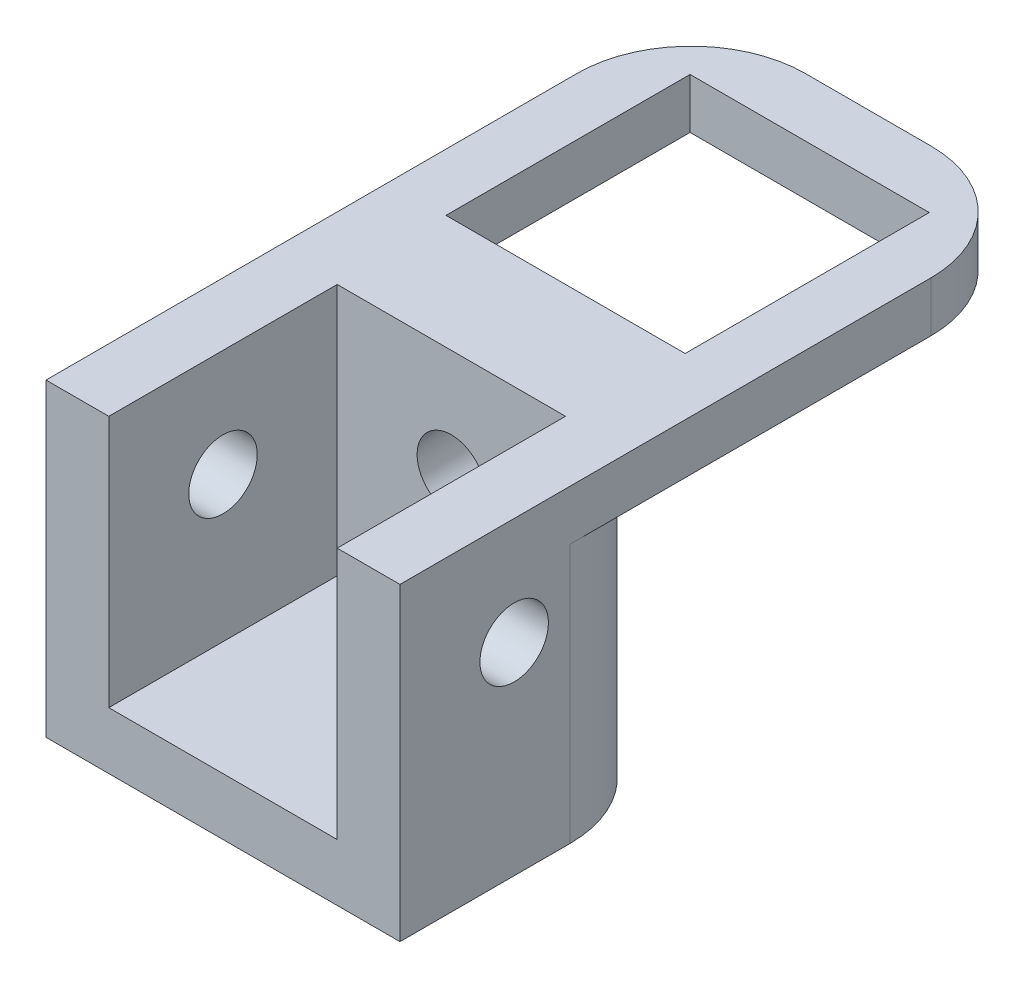
ISO-10303-21;
HEADER;
FILE_DESCRIPTION(('STEP AP214'),'2;1');
FILE_NAME('part.step','',(''),(''),'','','');
FILE_SCHEMA(('AUTOMOTIVE_DESIGN { 1 0 10303 214 1 1 1 1 }'));
ENDSEC;
DATA;
#1=APPLICATION_CONTEXT('core data for automotive mechanical design processes');
#2=APPLICATION_PROTOCOL_DEFINITION('international standard','automotive_design',2000,#1);
#3=PRODUCT_CONTEXT('',#1,'mechanical');
#4=PRODUCT('Part','Part','',(#3));
#5=PRODUCT_RELATED_PRODUCT_CATEGORY('part','',(#4));
#6=PRODUCT_DEFINITION_FORMATION('','',#4);
#7=PRODUCT_DEFINITION_CONTEXT('part definition',#1,'design');
#8=PRODUCT_DEFINITION('design','',#6,#7);
#9=PRODUCT_DEFINITION_SHAPE('','',#8);
#10=(LENGTH_UNIT() NAMED_UNIT(*) SI_UNIT(.MILLI.,.METRE.));
#11=(NAMED_UNIT(*) PLANE_ANGLE_UNIT() SI_UNIT($,.RADIAN.));
#12=(NAMED_UNIT(*) SI_UNIT($,.STERADIAN.) SOLID_ANGLE_UNIT());
#13=UNCERTAINTY_MEASURE_WITH_UNIT(LENGTH_MEASURE(1.E-05),#10,'distance_accuracy_value','');
#14=(GEOMETRIC_REPRESENTATION_CONTEXT(3) GLOBAL_UNCERTAINTY_ASSIGNED_CONTEXT((#13)) GLOBAL_UNIT_ASSIGNED_CONTEXT((#10,
#11,#12)) REPRESENTATION_CONTEXT('',''));
#15=CARTESIAN_POINT('',(0.,0.,0.));
#16=DIRECTION('',(0.,0.,1.));
#17=DIRECTION('',(1.,0.,0.));
#18=AXIS2_PLACEMENT_3D('',#15,#16,#17);
#19=CARTESIAN_POINT('',(-15.5,-4.4,20.405));
#20=DIRECTION('',(0.,0.,-1.));
#21=DIRECTION('',(-1.,0.,0.));
#22=AXIS2_PLACEMENT_3D('',#19,#20,#21);
#23=PLANE('',#22);
#24=CARTESIAN_POINT('',(0.,-9.4,20.405));
#25=DIRECTION('',(0.,0.,-1.));
#26=DIRECTION('',(-1.,0.,0.));
#27=AXIS2_PLACEMENT_3D('',#24,#25,#26);
#28=CIRCLE('',#27,3.);
#29=CARTESIAN_POINT('',(-3.,-9.4,20.405));
#30=VERTEX_POINT('',#29);
#31=EDGE_CURVE('E238',#30,#30,#28,.T.);
#32=ORIENTED_EDGE('',*,*,#31,.T.);
#33=EDGE_LOOP('',(#32));
#34=FACE_BOUND('',#33,.T.);
#35=DIRECTION('',(-1.,0.,0.));
#36=VECTOR('',#35,1.);
#37=CARTESIAN_POINT('',(15.502,-22.1,20.405));
#38=LINE('',#37,#36);
#39=CARTESIAN_POINT('',(10.,-22.1,20.405));
#40=VERTEX_POINT('',#39);
#41=CARTESIAN_POINT('',(-10.,-22.1,20.405));
#42=VERTEX_POINT('',#41);
#43=EDGE_CURVE('E171',#40,#42,#38,.T.);
#44=ORIENTED_EDGE('',*,*,#43,.F.);
#45=DIRECTION('',(0.,-1.,0.));
#46=VECTOR('',#45,1.);
#47=CARTESIAN_POINT('',(10.,0.,20.405));
#48=LINE('',#47,#46);
#49=CARTESIAN_POINT('',(10.,0.,20.405));
#50=VERTEX_POINT('',#49);
#51=EDGE_CURVE('E202',#50,#40,#48,.T.);
#52=ORIENTED_EDGE('',*,*,#51,.F.);
#53=DIRECTION('',(-1.,0.,0.));
#54=VECTOR('',#53,1.);
#55=CARTESIAN_POINT('',(-15.5,0.,20.405));
#56=LINE('',#55,#54);
#57=CARTESIAN_POINT('',(-10.,0.,20.405));
#58=VERTEX_POINT('',#57);
#59=EDGE_CURVE('E191',#50,#58,#56,.T.);
#60=ORIENTED_EDGE('',*,*,#59,.T.);
#61=DIRECTION('',(0.,1.,0.));
#62=VECTOR('',#61,1.);
#63=CARTESIAN_POINT('',(-10.,0.,20.405));
#64=LINE('',#63,#62);
#65=EDGE_CURVE('E185',#42,#58,#64,.T.);
#66=ORIENTED_EDGE('',*,*,#65,.F.);
#67=EDGE_LOOP('',(#44,#52,#60,#66));
#68=FACE_BOUND('',#67,.T.);
#69=ADVANCED_FACE('F45',(#34,#68),#23,.F.);
#70=CARTESIAN_POINT('',(10.,0.,68.0574863258261));
#71=DIRECTION('',(1.,0.,0.));
#72=DIRECTION('',(0.,1.,0.));
#73=AXIS2_PLACEMENT_3D('',#70,#71,#72);
#74=PLANE('',#73);
#75=CARTESIAN_POINT('',(10.,-9.4,30.405));
#76=DIRECTION('',(1.,0.,0.));
#77=DIRECTION('',(0.,1.,0.));
#78=AXIS2_PLACEMENT_3D('',#75,#76,#77);
#79=CIRCLE('',#78,3.);
#80=CARTESIAN_POINT('',(10.,-6.4,30.405));
#81=VERTEX_POINT('',#80);
#82=EDGE_CURVE('E286',#81,#81,#79,.T.);
#83=ORIENTED_EDGE('',*,*,#82,.T.);
#84=EDGE_LOOP('',(#83));
#85=FACE_BOUND('',#84,.T.);
#86=DIRECTION('',(0.,0.,1.));
#87=VECTOR('',#86,1.);
#88=CARTESIAN_POINT('',(10.,-22.1,40.405));
#89=LINE('',#88,#87);
#90=CARTESIAN_POINT('',(10.,-22.1,40.405));
#91=VERTEX_POINT('',#90);
#92=EDGE_CURVE('E174',#40,#91,#89,.T.);
#93=ORIENTED_EDGE('',*,*,#92,.T.);
#94=DIRECTION('',(0.,-1.,0.));
#95=VECTOR('',#94,1.);
#96=CARTESIAN_POINT('',(10.,0.,40.405));
#97=LINE('',#96,#95);
#98=CARTESIAN_POINT('',(10.,0.,40.405));
#99=VERTEX_POINT('',#98);
#100=EDGE_CURVE('E225',#99,#91,#97,.T.);
#101=ORIENTED_EDGE('',*,*,#100,.F.);
#102=DIRECTION('',(0.,0.,-1.));
#103=VECTOR('',#102,1.);
#104=CARTESIAN_POINT('',(10.,0.,68.0574863258261));
#105=LINE('',#104,#103);
#106=EDGE_CURVE('E195',#99,#50,#105,.T.);
#107=ORIENTED_EDGE('',*,*,#106,.T.);
#108=ORIENTED_EDGE('',*,*,#51,.T.);
#109=EDGE_LOOP('',(#93,#101,#107,#108));
#110=FACE_BOUND('',#109,.T.);
#111=ADVANCED_FACE('F434',(#85,#110),#74,.F.);
#112=CARTESIAN_POINT('',(-10.,0.,68.0574863258261));
#113=DIRECTION('',(-1.,0.,0.));
#114=DIRECTION('',(0.,-1.,0.));
#115=AXIS2_PLACEMENT_3D('',#112,#113,#114);
#116=PLANE('',#115);
#117=CARTESIAN_POINT('',(-10.,-9.4,30.405));
#118=DIRECTION('',(-1.,0.,0.));
#119=DIRECTION('',(0.,-1.,0.));
#120=AXIS2_PLACEMENT_3D('',#117,#118,#119);
#121=CIRCLE('',#120,3.);
#122=CARTESIAN_POINT('',(-10.,-12.4,30.405));
#123=VERTEX_POINT('',#122);
#124=EDGE_CURVE('E282',#123,#123,#121,.T.);
#125=ORIENTED_EDGE('',*,*,#124,.T.);
#126=EDGE_LOOP('',(#125));
#127=FACE_BOUND('',#126,.T.);
#128=DIRECTION('',(0.,0.,1.));
#129=VECTOR('',#128,1.);
#130=CARTESIAN_POINT('',(-10.,-22.1,40.405));
#131=LINE('',#130,#129);
#132=CARTESIAN_POINT('',(-10.,-22.1,40.405));
#133=VERTEX_POINT('',#132);
#134=EDGE_CURVE('E61',#42,#133,#131,.T.);
#135=ORIENTED_EDGE('',*,*,#134,.F.);
#136=ORIENTED_EDGE('',*,*,#65,.T.);
#137=DIRECTION('',(0.,0.,-1.));
#138=VECTOR('',#137,1.);
#139=CARTESIAN_POINT('',(-10.,0.,68.0574863258261));
#140=LINE('',#139,#138);
#141=CARTESIAN_POINT('',(-10.,0.,40.405));
#142=VERTEX_POINT('',#141);
#143=EDGE_CURVE('E194',#142,#58,#140,.T.);
#144=ORIENTED_EDGE('',*,*,#143,.F.);
#145=DIRECTION('',(0.,1.,0.));
#146=VECTOR('',#145,1.);
#147=CARTESIAN_POINT('',(-10.,0.,40.405));
#148=LINE('',#147,#146);
#149=EDGE_CURVE('E187',#133,#142,#148,.T.);
#150=ORIENTED_EDGE('',*,*,#149,.F.);
#151=EDGE_LOOP('',(#135,#136,#144,#150));
#152=FACE_BOUND('',#151,.T.);
#153=ADVANCED_FACE('F183',(#127,#152),#116,.F.);
#154=CARTESIAN_POINT('',(10.475,-4.4,-16.095));
#155=DIRECTION('',(1.,0.,0.));
#156=DIRECTION('',(0.,0.,-1.));
#157=AXIS2_PLACEMENT_3D('',#154,#155,#156);
#158=PLANE('',#157);
#159=DIRECTION('',(0.,1.,0.));
#160=VECTOR('',#159,1.);
#161=CARTESIAN_POINT('',(10.475,0.,-10.975));
#162=LINE('',#161,#160);
#163=CARTESIAN_POINT('',(10.475,-4.4,-10.975));
#164=VERTEX_POINT('',#163);
#165=CARTESIAN_POINT('',(10.475,0.,-10.975));
#166=VERTEX_POINT('',#165);
#167=EDGE_CURVE('E398',#164,#166,#162,.T.);
#168=ORIENTED_EDGE('',*,*,#167,.F.);
#169=DIRECTION('',(0.,0.,1.));
#170=VECTOR('',#169,1.);
#171=CARTESIAN_POINT('',(10.475,-4.4,-16.095));
#172=LINE('',#171,#170);
#173=CARTESIAN_POINT('',(10.475,-4.4,10.405));
#174=VERTEX_POINT('',#173);
#175=EDGE_CURVE('E394',#164,#174,#172,.T.);
#176=ORIENTED_EDGE('',*,*,#175,.T.);
#177=DIRECTION('',(0.,1.,0.));
#178=VECTOR('',#177,1.);
#179=CARTESIAN_POINT('',(10.475,-4.4,10.405));
#180=LINE('',#179,#178);
#181=CARTESIAN_POINT('',(10.475,0.,10.405));
#182=VERTEX_POINT('',#181);
#183=EDGE_CURVE('E383',#174,#182,#180,.T.);
#184=ORIENTED_EDGE('',*,*,#183,.T.);
#185=DIRECTION('',(0.,0.,1.));
#186=VECTOR('',#185,1.);
#187=CARTESIAN_POINT('',(10.475,0.,-16.095));
#188=LINE('',#187,#186);
#189=EDGE_CURVE('E397',#166,#182,#188,.T.);
#190=ORIENTED_EDGE('',*,*,#189,.F.);
#191=EDGE_LOOP('',(#168,#176,#184,#190));
#192=FACE_BOUND('',#191,.T.);
#193=ADVANCED_FACE('F491',(#192),#158,.F.);
#194=CARTESIAN_POINT('',(-10.475,-4.4,-16.095));
#195=DIRECTION('',(-1.,0.,0.));
#196=DIRECTION('',(0.,0.,1.));
#197=AXIS2_PLACEMENT_3D('',#194,#195,#196);
#198=PLANE('',#197);
#199=DIRECTION('',(0.,1.,0.));
#200=VECTOR('',#199,1.);
#201=CARTESIAN_POINT('',(-10.475,0.,-10.975));
#202=LINE('',#201,#200);
#203=CARTESIAN_POINT('',(-10.475,-4.4,-10.975));
#204=VERTEX_POINT('',#203);
#205=CARTESIAN_POINT('',(-10.475,0.,-10.975));
#206=VERTEX_POINT('',#205);
#207=EDGE_CURVE('E386',#204,#206,#202,.T.);
#208=ORIENTED_EDGE('',*,*,#207,.T.);
#209=DIRECTION('',(0.,0.,1.));
#210=VECTOR('',#209,1.);
#211=CARTESIAN_POINT('',(-10.475,0.,-16.095));
#212=LINE('',#211,#210);
#213=CARTESIAN_POINT('',(-10.475,0.,10.405));
#214=VERTEX_POINT('',#213);
#215=EDGE_CURVE('E391',#206,#214,#212,.T.);
#216=ORIENTED_EDGE('',*,*,#215,.T.);
#217=DIRECTION('',(0.,-1.,0.));
#218=VECTOR('',#217,1.);
#219=CARTESIAN_POINT('',(-10.475,-4.4,10.405));
#220=LINE('',#219,#218);
#221=CARTESIAN_POINT('',(-10.475,-4.4,10.405));
#222=VERTEX_POINT('',#221);
#223=EDGE_CURVE('E376',#214,#222,#220,.T.);
#224=ORIENTED_EDGE('',*,*,#223,.T.);
#225=DIRECTION('',(0.,0.,1.));
#226=VECTOR('',#225,1.);
#227=CARTESIAN_POINT('',(-10.475,-4.4,-16.095));
#228=LINE('',#227,#226);
#229=EDGE_CURVE('E380',#204,#222,#228,.T.);
#230=ORIENTED_EDGE('',*,*,#229,.F.);
#231=EDGE_LOOP('',(#208,#216,#224,#230));
#232=FACE_BOUND('',#231,.T.);
#233=ADVANCED_FACE('F451',(#232),#198,.F.);
#234=CARTESIAN_POINT('',(-15.5,-4.4,10.405));
#235=DIRECTION('',(0.,0.,1.));
#236=DIRECTION('',(1.,0.,0.));
#237=AXIS2_PLACEMENT_3D('',#234,#235,#236);
#238=PLANE('',#237);
#239=ORIENTED_EDGE('',*,*,#223,.F.);
#240=DIRECTION('',(1.,0.,0.));
#241=VECTOR('',#240,1.);
#242=CARTESIAN_POINT('',(-15.5,0.,10.405));
#243=LINE('',#242,#241);
#244=EDGE_CURVE('E273',#214,#182,#243,.T.);
#245=ORIENTED_EDGE('',*,*,#244,.T.);
#246=ORIENTED_EDGE('',*,*,#183,.F.);
#247=DIRECTION('',(1.,0.,0.));
#248=VECTOR('',#247,1.);
#249=CARTESIAN_POINT('',(-15.5,-4.4,10.405));
#250=LINE('',#249,#248);
#251=EDGE_CURVE('E262',#222,#174,#250,.T.);
#252=ORIENTED_EDGE('',*,*,#251,.F.);
#253=EDGE_LOOP('',(#239,#245,#246,#252));
#254=FACE_BOUND('',#253,.T.);
#255=ADVANCED_FACE('F448',(#254),#238,.F.);
#256=CARTESIAN_POINT('',(0.,-4.4,0.));
#257=DIRECTION('',(0.,1.,0.));
#258=DIRECTION('',(0.,0.,1.));
#259=AXIS2_PLACEMENT_3D('',#256,#257,#258);
#260=PLANE('',#259);
#261=ORIENTED_EDGE('',*,*,#175,.F.);
#262=DIRECTION('',(1.,0.,0.));
#263=VECTOR('',#262,1.);
#264=CARTESIAN_POINT('',(-15.502,-4.4,-10.975));
#265=LINE('',#264,#263);
#266=EDGE_CURVE('E478',#204,#164,#265,.T.);
#267=ORIENTED_EDGE('',*,*,#266,.F.);
#268=ORIENTED_EDGE('',*,*,#229,.T.);
#269=ORIENTED_EDGE('',*,*,#251,.T.);
#270=EDGE_LOOP('',(#261,#267,#268,#269));
#271=FACE_BOUND('',#270,.T.);
#272=DIRECTION('',(-1.,0.,0.));
#273=VECTOR('',#272,1.);
#274=CARTESIAN_POINT('',(-15.5,-4.4,-16.095));
#275=LINE('',#274,#273);
#276=CARTESIAN_POINT('',(5.49999999999999,-4.4,-16.095));
#277=VERTEX_POINT('',#276);
#278=CARTESIAN_POINT('',(-5.5,-4.4,-16.095));
#279=VERTEX_POINT('',#278);
#280=EDGE_CURVE('E371',#277,#279,#275,.T.);
#281=ORIENTED_EDGE('',*,*,#280,.F.);
#282=CARTESIAN_POINT('',(5.49999999999999,-4.4,-6.095));
#283=DIRECTION('',(0.,1.,0.));
#284=DIRECTION('',(0.,0.,1.));
#285=AXIS2_PLACEMENT_3D('',#282,#283,#284);
#286=CIRCLE('',#285,10.);
#287=CARTESIAN_POINT('',(15.5,-4.4,-6.09500000000001));
#288=VERTEX_POINT('',#287);
#289=EDGE_CURVE('E323',#277,#288,#286,.F.);
#290=ORIENTED_EDGE('',*,*,#289,.T.);
#291=DIRECTION('',(0.,0.,1.));
#292=VECTOR('',#291,1.);
#293=CARTESIAN_POINT('',(15.5,-4.4,10.405));
#294=LINE('',#293,#292);
#295=CARTESIAN_POINT('',(15.5,-4.4,25.505));
#296=VERTEX_POINT('',#295);
#297=EDGE_CURVE('E266',#288,#296,#294,.T.);
#298=ORIENTED_EDGE('',*,*,#297,.T.);
#299=CARTESIAN_POINT('',(5.5,-4.4,25.505));
#300=DIRECTION('',(0.,1.,0.));
#301=DIRECTION('',(0.,0.,1.));
#302=AXIS2_PLACEMENT_3D('',#299,#300,#301);
#303=CIRCLE('',#302,10.);
#304=CARTESIAN_POINT('',(5.5,-4.4,15.505));
#305=VERTEX_POINT('',#304);
#306=EDGE_CURVE('E54',#296,#305,#303,.T.);
#307=ORIENTED_EDGE('',*,*,#306,.T.);
#308=DIRECTION('',(1.,0.,0.));
#309=VECTOR('',#308,1.);
#310=CARTESIAN_POINT('',(-15.5,-4.4,15.505));
#311=LINE('',#310,#309);
#312=CARTESIAN_POINT('',(-5.5,-4.4,15.505));
#313=VERTEX_POINT('',#312);
#314=EDGE_CURVE('E242',#313,#305,#311,.T.);
#315=ORIENTED_EDGE('',*,*,#314,.F.);
#316=CARTESIAN_POINT('',(-5.5,-4.4,25.505));
#317=DIRECTION('',(0.,1.,0.));
#318=DIRECTION('',(0.,0.,1.));
#319=AXIS2_PLACEMENT_3D('',#316,#317,#318);
#320=CIRCLE('',#319,10.);
#321=CARTESIAN_POINT('',(-15.5,-4.4,25.505));
#322=VERTEX_POINT('',#321);
#323=EDGE_CURVE('E11',#313,#322,#320,.T.);
#324=ORIENTED_EDGE('',*,*,#323,.T.);
#325=DIRECTION('',(0.,0.,-1.));
#326=VECTOR('',#325,1.);
#327=CARTESIAN_POINT('',(-15.5,-4.4,10.405));
#328=LINE('',#327,#326);
#329=CARTESIAN_POINT('',(-15.5,-4.4,-6.095));
#330=VERTEX_POINT('',#329);
#331=EDGE_CURVE('E259',#322,#330,#328,.T.);
#332=ORIENTED_EDGE('',*,*,#331,.T.);
#333=CARTESIAN_POINT('',(-5.5,-4.4,-6.095));
#334=DIRECTION('',(0.,1.,0.));
#335=DIRECTION('',(0.,0.,1.));
#336=AXIS2_PLACEMENT_3D('',#333,#334,#335);
#337=CIRCLE('',#336,10.);
#338=EDGE_CURVE('E69',#330,#279,#337,.F.);
#339=ORIENTED_EDGE('',*,*,#338,.T.);
#340=EDGE_LOOP('',(#281,#290,#298,#307,#315,#324,#332,#339));
#341=FACE_BOUND('',#340,.T.);
#342=ADVANCED_FACE('F334',(#271,#341),#260,.F.);
#343=CARTESIAN_POINT('',(-15.5,-4.4,10.405));
#344=DIRECTION('',(1.,0.,0.));
#345=DIRECTION('',(0.,0.,-1.));
#346=AXIS2_PLACEMENT_3D('',#343,#344,#345);
#347=PLANE('',#346);
#348=CARTESIAN_POINT('',(-15.5,-9.4,30.405));
#349=DIRECTION('',(1.,0.,0.));
#350=DIRECTION('',(0.,0.,-1.));
#351=AXIS2_PLACEMENT_3D('',#348,#349,#350);
#352=CIRCLE('',#351,3.);
#353=CARTESIAN_POINT('',(-15.5,-9.4,27.405));
#354=VERTEX_POINT('',#353);
#355=EDGE_CURVE('E206',#354,#354,#352,.T.);
#356=ORIENTED_EDGE('',*,*,#355,.T.);
#357=EDGE_LOOP('',(#356));
#358=FACE_BOUND('',#357,.T.);
#359=ORIENTED_EDGE('',*,*,#331,.F.);
#360=DIRECTION('',(0.,1.,0.));
#361=VECTOR('',#360,1.);
#362=CARTESIAN_POINT('',(-15.5,-4.4,25.505));
#363=LINE('',#362,#361);
#364=CARTESIAN_POINT('',(-15.5,-27.1,25.505));
#365=VERTEX_POINT('',#364);
#366=EDGE_CURVE('E310',#322,#365,#363,.F.);
#367=ORIENTED_EDGE('',*,*,#366,.T.);
#368=DIRECTION('',(0.,0.,-1.));
#369=VECTOR('',#368,1.);
#370=CARTESIAN_POINT('',(-15.5,-27.1,20.405));
#371=LINE('',#370,#369);
#372=CARTESIAN_POINT('',(-15.5,-27.1,40.405));
#373=VERTEX_POINT('',#372);
#374=EDGE_CURVE('E243',#373,#365,#371,.T.);
#375=ORIENTED_EDGE('',*,*,#374,.F.);
#376=DIRECTION('',(0.,-1.,0.));
#377=VECTOR('',#376,1.);
#378=CARTESIAN_POINT('',(-15.5,0.,40.405));
#379=LINE('',#378,#377);
#380=CARTESIAN_POINT('',(-15.5,0.,40.405));
#381=VERTEX_POINT('',#380);
#382=EDGE_CURVE('E214',#381,#373,#379,.T.);
#383=ORIENTED_EDGE('',*,*,#382,.F.);
#384=DIRECTION('',(0.,0.,-1.));
#385=VECTOR('',#384,1.);
#386=CARTESIAN_POINT('',(-15.5,0.,10.405));
#387=LINE('',#386,#385);
#388=CARTESIAN_POINT('',(-15.5,0.,-6.095));
#389=VERTEX_POINT('',#388);
#390=EDGE_CURVE('E255',#381,#389,#387,.T.);
#391=ORIENTED_EDGE('',*,*,#390,.T.);
#392=DIRECTION('',(0.,1.,0.));
#393=VECTOR('',#392,1.);
#394=CARTESIAN_POINT('',(-15.5,-4.4,-6.095));
#395=LINE('',#394,#393);
#396=EDGE_CURVE('E307',#389,#330,#395,.F.);
#397=ORIENTED_EDGE('',*,*,#396,.T.);
#398=EDGE_LOOP('',(#359,#367,#375,#383,#391,#397));
#399=FACE_BOUND('',#398,.T.);
#400=ADVANCED_FACE('F414',(#358,#399),#347,.F.);
#401=CARTESIAN_POINT('',(15.5,-4.4,10.405));
#402=DIRECTION('',(-1.,0.,0.));
#403=DIRECTION('',(0.,0.,1.));
#404=AXIS2_PLACEMENT_3D('',#401,#402,#403);
#405=PLANE('',#404);
#406=CARTESIAN_POINT('',(15.5,-9.4,30.405));
#407=DIRECTION('',(1.,0.,0.));
#408=DIRECTION('',(0.,0.,-1.));
#409=AXIS2_PLACEMENT_3D('',#406,#407,#408);
#410=CIRCLE('',#409,3.);
#411=CARTESIAN_POINT('',(15.5,-9.4,27.405));
#412=VERTEX_POINT('',#411);
#413=EDGE_CURVE('E287',#412,#412,#410,.T.);
#414=ORIENTED_EDGE('',*,*,#413,.F.);
#415=EDGE_LOOP('',(#414));
#416=FACE_BOUND('',#415,.T.);
#417=DIRECTION('',(0.,0.,1.));
#418=VECTOR('',#417,1.);
#419=CARTESIAN_POINT('',(15.5,-27.1,20.405));
#420=LINE('',#419,#418);
#421=CARTESIAN_POINT('',(15.5,-27.1,25.505));
#422=VERTEX_POINT('',#421);
#423=CARTESIAN_POINT('',(15.5,-27.1,40.405));
#424=VERTEX_POINT('',#423);
#425=EDGE_CURVE('E251',#422,#424,#420,.T.);
#426=ORIENTED_EDGE('',*,*,#425,.F.);
#427=DIRECTION('',(0.,1.,0.));
#428=VECTOR('',#427,1.);
#429=CARTESIAN_POINT('',(15.5,-4.4,25.505));
#430=LINE('',#429,#428);
#431=EDGE_CURVE('E290',#422,#296,#430,.T.);
#432=ORIENTED_EDGE('',*,*,#431,.T.);
#433=ORIENTED_EDGE('',*,*,#297,.F.);
#434=DIRECTION('',(0.,-1.,0.));
#435=VECTOR('',#434,1.);
#436=CARTESIAN_POINT('',(15.5,0.,-6.095));
#437=LINE('',#436,#435);
#438=CARTESIAN_POINT('',(15.5,0.,-6.09500000000001));
#439=VERTEX_POINT('',#438);
#440=EDGE_CURVE('E269',#288,#439,#437,.F.);
#441=ORIENTED_EDGE('',*,*,#440,.T.);
#442=DIRECTION('',(0.,0.,1.));
#443=VECTOR('',#442,1.);
#444=CARTESIAN_POINT('',(15.5,0.,10.405));
#445=LINE('',#444,#443);
#446=CARTESIAN_POINT('',(15.5,0.,40.405));
#447=VERTEX_POINT('',#446);
#448=EDGE_CURVE('E277',#439,#447,#445,.T.);
#449=ORIENTED_EDGE('',*,*,#448,.T.);
#450=DIRECTION('',(0.,1.,0.));
#451=VECTOR('',#450,1.);
#452=CARTESIAN_POINT('',(15.5,0.,40.405));
#453=LINE('',#452,#451);
#454=EDGE_CURVE('E229',#424,#447,#453,.T.);
#455=ORIENTED_EDGE('',*,*,#454,.F.);
#456=EDGE_LOOP('',(#426,#432,#433,#441,#449,#455));
#457=FACE_BOUND('',#456,.T.);
#458=ADVANCED_FACE('F351',(#416,#457),#405,.F.);
#459=CARTESIAN_POINT('',(0.,0.,0.));
#460=DIRECTION('',(0.,1.,0.));
#461=DIRECTION('',(0.,0.,1.));
#462=AXIS2_PLACEMENT_3D('',#459,#460,#461);
#463=PLANE('',#462);
#464=DIRECTION('',(1.,0.,0.));
#465=VECTOR('',#464,1.);
#466=CARTESIAN_POINT('',(-15.502,0.,-10.975));
#467=LINE('',#466,#465);
#468=EDGE_CURVE('E477',#206,#166,#467,.T.);
#469=ORIENTED_EDGE('',*,*,#468,.T.);
#470=ORIENTED_EDGE('',*,*,#189,.T.);
#471=ORIENTED_EDGE('',*,*,#244,.F.);
#472=ORIENTED_EDGE('',*,*,#215,.F.);
#473=EDGE_LOOP('',(#469,#470,#471,#472));
#474=FACE_BOUND('',#473,.T.);
#475=ORIENTED_EDGE('',*,*,#448,.F.);
#476=CARTESIAN_POINT('',(5.49999999999999,0.,-6.095));
#477=DIRECTION('',(0.,1.,0.));
#478=DIRECTION('',(0.,0.,1.));
#479=AXIS2_PLACEMENT_3D('',#476,#477,#478);
#480=CIRCLE('',#479,10.);
#481=CARTESIAN_POINT('',(5.49999999999999,0.,-16.095));
#482=VERTEX_POINT('',#481);
#483=EDGE_CURVE('E329',#439,#482,#480,.T.);
#484=ORIENTED_EDGE('',*,*,#483,.T.);
#485=DIRECTION('',(1.,0.,0.));
#486=VECTOR('',#485,1.);
#487=CARTESIAN_POINT('',(-15.5,0.,-16.095));
#488=LINE('',#487,#486);
#489=CARTESIAN_POINT('',(-5.5,0.,-16.095));
#490=VERTEX_POINT('',#489);
#491=EDGE_CURVE('E369',#490,#482,#488,.T.);
#492=ORIENTED_EDGE('',*,*,#491,.F.);
#493=CARTESIAN_POINT('',(-5.5,0.,-6.095));
#494=DIRECTION('',(0.,1.,0.));
#495=DIRECTION('',(0.,0.,1.));
#496=AXIS2_PLACEMENT_3D('',#493,#494,#495);
#497=CIRCLE('',#496,10.);
#498=EDGE_CURVE('E326',#490,#389,#497,.T.);
#499=ORIENTED_EDGE('',*,*,#498,.T.);
#500=ORIENTED_EDGE('',*,*,#390,.F.);
#501=DIRECTION('',(-1.,0.,0.));
#502=VECTOR('',#501,1.);
#503=CARTESIAN_POINT('',(-15.5,0.,40.405));
#504=LINE('',#503,#502);
#505=EDGE_CURVE('E199',#142,#381,#504,.T.);
#506=ORIENTED_EDGE('',*,*,#505,.F.);
#507=ORIENTED_EDGE('',*,*,#143,.T.);
#508=ORIENTED_EDGE('',*,*,#59,.F.);
#509=ORIENTED_EDGE('',*,*,#106,.F.);
#510=DIRECTION('',(-1.,0.,0.));
#511=VECTOR('',#510,1.);
#512=CARTESIAN_POINT('',(10.,0.,40.405));
#513=LINE('',#512,#511);
#514=EDGE_CURVE('E221',#447,#99,#513,.T.);
#515=ORIENTED_EDGE('',*,*,#514,.F.);
#516=EDGE_LOOP('',(#475,#484,#492,#499,#500,#506,#507,#508,#509,#515));
#517=FACE_BOUND('',#516,.T.);
#518=ADVANCED_FACE('F373',(#474,#517),#463,.T.);
#519=CARTESIAN_POINT('',(-15.5,-27.1,15.505));
#520=DIRECTION('',(0.,0.,1.));
#521=DIRECTION('',(1.,0.,0.));
#522=AXIS2_PLACEMENT_3D('',#519,#520,#521);
#523=PLANE('',#522);
#524=CARTESIAN_POINT('',(0.,-9.4,15.505));
#525=DIRECTION('',(0.,0.,-1.));
#526=DIRECTION('',(-1.,0.,0.));
#527=AXIS2_PLACEMENT_3D('',#524,#525,#526);
#528=CIRCLE('',#527,3.);
#529=CARTESIAN_POINT('',(-3.,-9.4,15.505));
#530=VERTEX_POINT('',#529);
#531=EDGE_CURVE('E210',#530,#530,#528,.T.);
#532=ORIENTED_EDGE('',*,*,#531,.F.);
#533=EDGE_LOOP('',(#532));
#534=FACE_BOUND('',#533,.T.);
#535=ORIENTED_EDGE('',*,*,#314,.T.);
#536=DIRECTION('',(0.,1.,0.));
#537=VECTOR('',#536,1.);
#538=CARTESIAN_POINT('',(5.5,-27.1,15.505));
#539=LINE('',#538,#537);
#540=CARTESIAN_POINT('',(5.5,-27.1,15.505));
#541=VERTEX_POINT('',#540);
#542=EDGE_CURVE('E298',#305,#541,#539,.F.);
#543=ORIENTED_EDGE('',*,*,#542,.T.);
#544=DIRECTION('',(1.,0.,0.));
#545=VECTOR('',#544,1.);
#546=CARTESIAN_POINT('',(-15.5,-27.1,15.505));
#547=LINE('',#546,#545);
#548=CARTESIAN_POINT('',(-5.5,-27.1,15.505));
#549=VERTEX_POINT('',#548);
#550=EDGE_CURVE('E247',#549,#541,#547,.T.);
#551=ORIENTED_EDGE('',*,*,#550,.F.);
#552=DIRECTION('',(0.,1.,0.));
#553=VECTOR('',#552,1.);
#554=CARTESIAN_POINT('',(-5.5,-27.1,15.505));
#555=LINE('',#554,#553);
#556=EDGE_CURVE('E294',#549,#313,#555,.T.);
#557=ORIENTED_EDGE('',*,*,#556,.T.);
#558=EDGE_LOOP('',(#535,#543,#551,#557));
#559=FACE_BOUND('',#558,.T.);
#560=ADVANCED_FACE('F340',(#534,#559),#523,.F.);
#561=CARTESIAN_POINT('',(0.,-27.1,0.));
#562=DIRECTION('',(0.,-1.,0.));
#563=DIRECTION('',(0.,0.,-1.));
#564=AXIS2_PLACEMENT_3D('',#561,#562,#563);
#565=PLANE('',#564);
#566=ORIENTED_EDGE('',*,*,#550,.T.);
#567=CARTESIAN_POINT('',(5.5,-27.1,25.505));
#568=DIRECTION('',(0.,-1.,0.));
#569=DIRECTION('',(0.,0.,-1.));
#570=AXIS2_PLACEMENT_3D('',#567,#568,#569);
#571=CIRCLE('',#570,10.);
#572=EDGE_CURVE('E304',#541,#422,#571,.T.);
#573=ORIENTED_EDGE('',*,*,#572,.T.);
#574=ORIENTED_EDGE('',*,*,#425,.T.);
#575=DIRECTION('',(1.,0.,0.));
#576=VECTOR('',#575,1.);
#577=CARTESIAN_POINT('',(-15.5,-27.1,40.405));
#578=LINE('',#577,#576);
#579=EDGE_CURVE('E211',#373,#424,#578,.T.);
#580=ORIENTED_EDGE('',*,*,#579,.F.);
#581=ORIENTED_EDGE('',*,*,#374,.T.);
#582=CARTESIAN_POINT('',(-5.5,-27.1,25.505));
#583=DIRECTION('',(0.,-1.,0.));
#584=DIRECTION('',(0.,0.,-1.));
#585=AXIS2_PLACEMENT_3D('',#582,#583,#584);
#586=CIRCLE('',#585,10.);
#587=EDGE_CURVE('E301',#365,#549,#586,.T.);
#588=ORIENTED_EDGE('',*,*,#587,.T.);
#589=EDGE_LOOP('',(#566,#573,#574,#580,#581,#588));
#590=FACE_BOUND('',#589,.T.);
#591=ADVANCED_FACE('F347',(#590),#565,.T.);
#592=CARTESIAN_POINT('',(0.,-9.4,40.405));
#593=DIRECTION('',(0.,0.,-1.));
#594=DIRECTION('',(-1.,0.,0.));
#595=AXIS2_PLACEMENT_3D('',#592,#593,#594);
#596=CYLINDRICAL_SURFACE('',#595,3.);
#597=ORIENTED_EDGE('',*,*,#531,.T.);
#598=EDGE_LOOP('',(#597));
#599=FACE_BOUND('',#598,.T.);
#600=ORIENTED_EDGE('',*,*,#31,.F.);
#601=EDGE_LOOP('',(#600));
#602=FACE_BOUND('',#601,.T.);
#603=ADVANCED_FACE('F428',(#599,#602),#596,.F.);
#604=CARTESIAN_POINT('',(-10.,-95.2,40.405));
#605=DIRECTION('',(0.,0.,1.));
#606=DIRECTION('',(1.,0.,0.));
#607=AXIS2_PLACEMENT_3D('',#604,#605,#606);
#608=PLANE('',#607);
#609=ORIENTED_EDGE('',*,*,#505,.T.);
#610=ORIENTED_EDGE('',*,*,#382,.T.);
#611=ORIENTED_EDGE('',*,*,#579,.T.);
#612=ORIENTED_EDGE('',*,*,#454,.T.);
#613=ORIENTED_EDGE('',*,*,#514,.T.);
#614=ORIENTED_EDGE('',*,*,#100,.T.);
#615=DIRECTION('',(-1.,0.,0.));
#616=VECTOR('',#615,1.);
#617=CARTESIAN_POINT('',(15.502,-22.1,40.405));
#618=LINE('',#617,#616);
#619=EDGE_CURVE('E179',#91,#133,#618,.T.);
#620=ORIENTED_EDGE('',*,*,#619,.T.);
#621=ORIENTED_EDGE('',*,*,#149,.T.);
#622=EDGE_LOOP('',(#609,#610,#611,#612,#613,#614,#620,#621));
#623=FACE_BOUND('',#622,.T.);
#624=ADVANCED_FACE('F355',(#623),#608,.T.);
#625=CARTESIAN_POINT('',(-19.595,-9.4,30.405));
#626=DIRECTION('',(1.,0.,0.));
#627=DIRECTION('',(0.,0.,-1.));
#628=AXIS2_PLACEMENT_3D('',#625,#626,#627);
#629=CYLINDRICAL_SURFACE('',#628,3.);
#630=ORIENTED_EDGE('',*,*,#124,.F.);
#631=EDGE_LOOP('',(#630));
#632=FACE_BOUND('',#631,.T.);
#633=ORIENTED_EDGE('',*,*,#355,.F.);
#634=EDGE_LOOP('',(#633));
#635=FACE_BOUND('',#634,.T.);
#636=ADVANCED_FACE('F416',(#632,#635),#629,.F.);
#637=ORIENTED_EDGE('',*,*,#413,.T.);
#638=EDGE_LOOP('',(#637));
#639=FACE_BOUND('',#638,.T.);
#640=ORIENTED_EDGE('',*,*,#82,.F.);
#641=EDGE_LOOP('',(#640));
#642=FACE_BOUND('',#641,.T.);
#643=ADVANCED_FACE('F418',(#639,#642),#629,.F.);
#644=CARTESIAN_POINT('',(0.,0.,-16.095));
#645=DIRECTION('',(0.,0.,-1.));
#646=DIRECTION('',(-1.,0.,0.));
#647=AXIS2_PLACEMENT_3D('',#644,#645,#646);
#648=PLANE('',#647);
#649=ORIENTED_EDGE('',*,*,#491,.T.);
#650=DIRECTION('',(0.,-1.,0.));
#651=VECTOR('',#650,1.);
#652=CARTESIAN_POINT('',(5.49999999999999,-4.4,-16.095));
#653=LINE('',#652,#651);
#654=EDGE_CURVE('E317',#482,#277,#653,.T.);
#655=ORIENTED_EDGE('',*,*,#654,.T.);
#656=ORIENTED_EDGE('',*,*,#280,.T.);
#657=DIRECTION('',(0.,1.,0.));
#658=VECTOR('',#657,1.);
#659=CARTESIAN_POINT('',(-5.5,0.,-16.095));
#660=LINE('',#659,#658);
#661=EDGE_CURVE('E313',#279,#490,#660,.T.);
#662=ORIENTED_EDGE('',*,*,#661,.T.);
#663=EDGE_LOOP('',(#649,#655,#656,#662));
#664=FACE_BOUND('',#663,.T.);
#665=ADVANCED_FACE('F368',(#664),#648,.T.);
#666=CARTESIAN_POINT('',(-15.502,0.,-10.975));
#667=DIRECTION('',(0.,0.,-1.));
#668=DIRECTION('',(-1.,0.,0.));
#669=AXIS2_PLACEMENT_3D('',#666,#667,#668);
#670=PLANE('',#669);
#671=ORIENTED_EDGE('',*,*,#207,.F.);
#672=ORIENTED_EDGE('',*,*,#266,.T.);
#673=ORIENTED_EDGE('',*,*,#167,.T.);
#674=ORIENTED_EDGE('',*,*,#468,.F.);
#675=EDGE_LOOP('',(#671,#672,#673,#674));
#676=FACE_BOUND('',#675,.T.);
#677=ADVANCED_FACE('F457',(#676),#670,.F.);
#678=CARTESIAN_POINT('',(5.5,-4.4,25.505));
#679=DIRECTION('',(0.,1.,0.));
#680=DIRECTION('',(0.,0.,1.));
#681=AXIS2_PLACEMENT_3D('',#678,#679,#680);
#682=CYLINDRICAL_SURFACE('',#681,10.);
#683=ORIENTED_EDGE('',*,*,#572,.F.);
#684=ORIENTED_EDGE('',*,*,#542,.F.);
#685=ORIENTED_EDGE('',*,*,#306,.F.);
#686=ORIENTED_EDGE('',*,*,#431,.F.);
#687=EDGE_LOOP('',(#683,#684,#685,#686));
#688=FACE_BOUND('',#687,.T.);
#689=ADVANCED_FACE('F344',(#688),#682,.T.);
#690=CARTESIAN_POINT('',(-5.5,-27.1,25.505));
#691=DIRECTION('',(0.,1.,0.));
#692=DIRECTION('',(0.,0.,1.));
#693=AXIS2_PLACEMENT_3D('',#690,#691,#692);
#694=CYLINDRICAL_SURFACE('',#693,10.);
#695=ORIENTED_EDGE('',*,*,#587,.F.);
#696=ORIENTED_EDGE('',*,*,#366,.F.);
#697=ORIENTED_EDGE('',*,*,#323,.F.);
#698=ORIENTED_EDGE('',*,*,#556,.F.);
#699=EDGE_LOOP('',(#695,#696,#697,#698));
#700=FACE_BOUND('',#699,.T.);
#701=ADVANCED_FACE('F361',(#700),#694,.T.);
#702=CARTESIAN_POINT('',(5.49999999999999,0.,-6.095));
#703=DIRECTION('',(0.,1.,0.));
#704=DIRECTION('',(0.,0.,1.));
#705=AXIS2_PLACEMENT_3D('',#702,#703,#704);
#706=CYLINDRICAL_SURFACE('',#705,10.);
#707=ORIENTED_EDGE('',*,*,#483,.F.);
#708=ORIENTED_EDGE('',*,*,#440,.F.);
#709=ORIENTED_EDGE('',*,*,#289,.F.);
#710=ORIENTED_EDGE('',*,*,#654,.F.);
#711=EDGE_LOOP('',(#707,#708,#709,#710));
#712=FACE_BOUND('',#711,.T.);
#713=ADVANCED_FACE('F459',(#712),#706,.T.);
#714=CARTESIAN_POINT('',(-5.5,0.,-6.095));
#715=DIRECTION('',(0.,-1.,0.));
#716=DIRECTION('',(0.,0.,-1.));
#717=AXIS2_PLACEMENT_3D('',#714,#715,#716);
#718=CYLINDRICAL_SURFACE('',#717,10.);
#719=ORIENTED_EDGE('',*,*,#338,.F.);
#720=ORIENTED_EDGE('',*,*,#396,.F.);
#721=ORIENTED_EDGE('',*,*,#498,.F.);
#722=ORIENTED_EDGE('',*,*,#661,.F.);
#723=EDGE_LOOP('',(#719,#720,#721,#722));
#724=FACE_BOUND('',#723,.T.);
#725=ADVANCED_FACE('F47',(#724),#718,.T.);
#726=CARTESIAN_POINT('',(15.502,-22.1,40.405));
#727=DIRECTION('',(0.,-1.,0.));
#728=DIRECTION('',(1.,0.,0.));
#729=AXIS2_PLACEMENT_3D('',#726,#727,#728);
#730=PLANE('',#729);
#731=ORIENTED_EDGE('',*,*,#92,.F.);
#732=ORIENTED_EDGE('',*,*,#43,.T.);
#733=ORIENTED_EDGE('',*,*,#134,.T.);
#734=ORIENTED_EDGE('',*,*,#619,.F.);
#735=EDGE_LOOP('',(#731,#732,#733,#734));
#736=FACE_BOUND('',#735,.T.);
#737=ADVANCED_FACE('F172',(#736),#730,.F.);
#738=CLOSED_SHELL('',(#69,#111,#153,#193,#233,#255,#342,#400,#458,#518,#560,#591,#603,#624,#636,
#643,#665,#677,#689,#701,#713,#725,#737));
#739=MANIFOLD_SOLID_BREP('B2',#738);
#740=ADVANCED_BREP_SHAPE_REPRESENTATION('',(#18,#739),#14);
#741=SHAPE_DEFINITION_REPRESENTATION(#9,#740);
ENDSEC;
END-ISO-10303-21;
